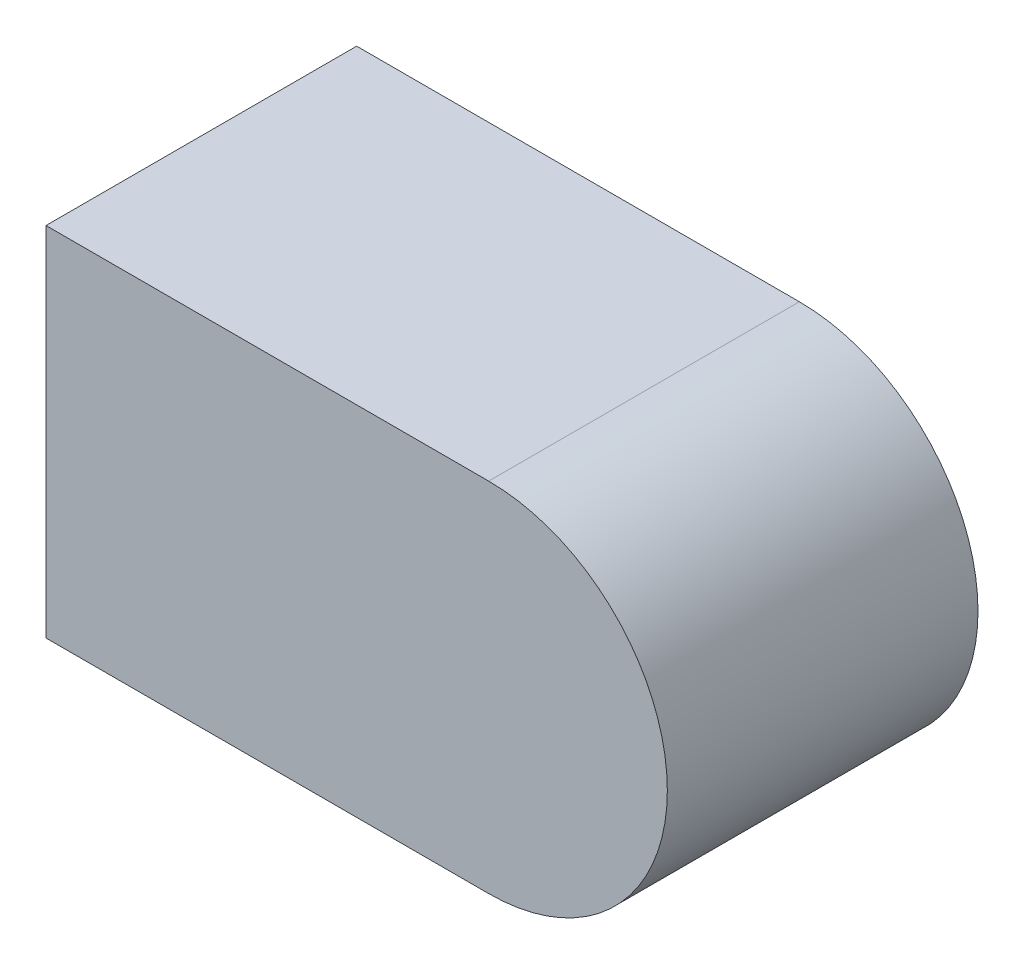
ISO-10303-21;
HEADER;
FILE_DESCRIPTION(('STEP AP214'),'2;1');
FILE_NAME('part.step','',(''),(''),'','','');
FILE_SCHEMA(('AUTOMOTIVE_DESIGN { 1 0 10303 214 1 1 1 1 }'));
ENDSEC;
DATA;
#1=APPLICATION_CONTEXT('core data for automotive mechanical design processes');
#2=APPLICATION_PROTOCOL_DEFINITION('international standard','automotive_design',2000,#1);
#3=PRODUCT_CONTEXT('',#1,'mechanical');
#4=PRODUCT('Part','Part','',(#3));
#5=PRODUCT_RELATED_PRODUCT_CATEGORY('part','',(#4));
#6=PRODUCT_DEFINITION_FORMATION('','',#4);
#7=PRODUCT_DEFINITION_CONTEXT('part definition',#1,'design');
#8=PRODUCT_DEFINITION('design','',#6,#7);
#9=PRODUCT_DEFINITION_SHAPE('','',#8);
#10=(LENGTH_UNIT() NAMED_UNIT(*) SI_UNIT(.MILLI.,.METRE.));
#11=(NAMED_UNIT(*) PLANE_ANGLE_UNIT() SI_UNIT($,.RADIAN.));
#12=(NAMED_UNIT(*) SI_UNIT($,.STERADIAN.) SOLID_ANGLE_UNIT());
#13=UNCERTAINTY_MEASURE_WITH_UNIT(LENGTH_MEASURE(1.E-05),#10,'distance_accuracy_value','');
#14=(GEOMETRIC_REPRESENTATION_CONTEXT(3) GLOBAL_UNCERTAINTY_ASSIGNED_CONTEXT((#13)) GLOBAL_UNIT_ASSIGNED_CONTEXT((#10,
#11,#12)) REPRESENTATION_CONTEXT('',''));
#15=CARTESIAN_POINT('',(0.,0.,0.));
#16=DIRECTION('',(0.,0.,1.));
#17=DIRECTION('',(1.,0.,0.));
#18=AXIS2_PLACEMENT_3D('',#15,#16,#17);
#19=CARTESIAN_POINT('',(-2.8335265642716,2.25,0.));
#20=DIRECTION('',(0.,0.,1.));
#21=DIRECTION('',(1.,0.,0.));
#22=AXIS2_PLACEMENT_3D('',#19,#20,#21);
#23=PLANE('',#22);
#24=DIRECTION('',(0.,-1.,0.));
#25=VECTOR('',#24,1.);
#26=CARTESIAN_POINT('',(-3.,2.365,0.));
#27=LINE('',#26,#25);
#28=CARTESIAN_POINT('',(-3.,2.365,0.));
#29=VERTEX_POINT('',#28);
#30=CARTESIAN_POINT('',(-3.,2.135,0.));
#31=VERTEX_POINT('',#30);
#32=EDGE_CURVE('E11',#29,#31,#27,.T.);
#33=ORIENTED_EDGE('',*,*,#32,.F.);
#34=DIRECTION('',(-1.,0.,0.));
#35=VECTOR('',#34,1.);
#36=CARTESIAN_POINT('',(-2.715,2.365,0.));
#37=LINE('',#36,#35);
#38=CARTESIAN_POINT('',(-2.715,2.365,0.));
#39=VERTEX_POINT('',#38);
#40=EDGE_CURVE('E24',#39,#29,#37,.T.);
#41=ORIENTED_EDGE('',*,*,#40,.F.);
#42=CARTESIAN_POINT('',(-2.715,2.25,0.));
#43=DIRECTION('',(0.,0.,1.));
#44=DIRECTION('',(0.,-1.,0.));
#45=AXIS2_PLACEMENT_3D('',#42,#43,#44);
#46=CIRCLE('',#45,0.115);
#47=CARTESIAN_POINT('',(-2.715,2.135,0.));
#48=VERTEX_POINT('',#47);
#49=EDGE_CURVE('E85',#48,#39,#46,.T.);
#50=ORIENTED_EDGE('',*,*,#49,.F.);
#51=DIRECTION('',(1.,0.,0.));
#52=VECTOR('',#51,1.);
#53=CARTESIAN_POINT('',(-3.,2.135,0.));
#54=LINE('',#53,#52);
#55=EDGE_CURVE('E82',#31,#48,#54,.T.);
#56=ORIENTED_EDGE('',*,*,#55,.F.);
#57=EDGE_LOOP('',(#33,#41,#50,#56));
#58=FACE_BOUND('',#57,.T.);
#59=ADVANCED_FACE('F17',(#58),#23,.F.);
#60=CARTESIAN_POINT('',(-3.,2.135,0.));
#61=DIRECTION('',(0.,-1.,0.));
#62=DIRECTION('',(1.,0.,0.));
#63=AXIS2_PLACEMENT_3D('',#60,#61,#62);
#64=PLANE('',#63);
#65=ORIENTED_EDGE('',*,*,#55,.T.);
#66=DIRECTION('',(0.,0.,1.));
#67=VECTOR('',#66,1.);
#68=CARTESIAN_POINT('',(-2.715,2.135,0.));
#69=LINE('',#68,#67);
#70=CARTESIAN_POINT('',(-2.715,2.135,0.2));
#71=VERTEX_POINT('',#70);
#72=EDGE_CURVE('E80',#48,#71,#69,.T.);
#73=ORIENTED_EDGE('',*,*,#72,.T.);
#74=DIRECTION('',(1.,0.,0.));
#75=VECTOR('',#74,1.);
#76=CARTESIAN_POINT('',(-3.,2.135,0.2));
#77=LINE('',#76,#75);
#78=CARTESIAN_POINT('',(-3.,2.135,0.2));
#79=VERTEX_POINT('',#78);
#80=EDGE_CURVE('E78',#79,#71,#77,.T.);
#81=ORIENTED_EDGE('',*,*,#80,.F.);
#82=DIRECTION('',(0.,0.,-1.));
#83=VECTOR('',#82,1.);
#84=CARTESIAN_POINT('',(-3.,2.135,0.));
#85=LINE('',#84,#83);
#86=EDGE_CURVE('E71',#79,#31,#85,.T.);
#87=ORIENTED_EDGE('',*,*,#86,.T.);
#88=EDGE_LOOP('',(#65,#73,#81,#87));
#89=FACE_BOUND('',#88,.T.);
#90=ADVANCED_FACE('F91',(#89),#64,.T.);
#91=CARTESIAN_POINT('',(-2.715,2.25,0.));
#92=DIRECTION('',(0.,0.,1.));
#93=DIRECTION('',(0.,-1.,0.));
#94=AXIS2_PLACEMENT_3D('',#91,#92,#93);
#95=CYLINDRICAL_SURFACE('',#94,0.115);
#96=ORIENTED_EDGE('',*,*,#49,.T.);
#97=DIRECTION('',(0.,0.,1.));
#98=VECTOR('',#97,1.);
#99=CARTESIAN_POINT('',(-2.715,2.365,0.));
#100=LINE('',#99,#98);
#101=CARTESIAN_POINT('',(-2.715,2.365,0.2));
#102=VERTEX_POINT('',#101);
#103=EDGE_CURVE('E75',#39,#102,#100,.T.);
#104=ORIENTED_EDGE('',*,*,#103,.T.);
#105=CARTESIAN_POINT('',(-2.715,2.25,0.2));
#106=DIRECTION('',(0.,0.,1.));
#107=DIRECTION('',(0.,-1.,0.));
#108=AXIS2_PLACEMENT_3D('',#105,#106,#107);
#109=CIRCLE('',#108,0.115);
#110=EDGE_CURVE('E59',#71,#102,#109,.T.);
#111=ORIENTED_EDGE('',*,*,#110,.F.);
#112=ORIENTED_EDGE('',*,*,#72,.F.);
#113=EDGE_LOOP('',(#96,#104,#111,#112));
#114=FACE_BOUND('',#113,.T.);
#115=ADVANCED_FACE('F89',(#114),#95,.T.);
#116=CARTESIAN_POINT('',(-2.715,2.365,0.));
#117=DIRECTION('',(0.,1.,0.));
#118=DIRECTION('',(-1.,0.,0.));
#119=AXIS2_PLACEMENT_3D('',#116,#117,#118);
#120=PLANE('',#119);
#121=ORIENTED_EDGE('',*,*,#40,.T.);
#122=DIRECTION('',(0.,0.,1.));
#123=VECTOR('',#122,1.);
#124=CARTESIAN_POINT('',(-3.,2.365,0.));
#125=LINE('',#124,#123);
#126=CARTESIAN_POINT('',(-3.,2.365,0.2));
#127=VERTEX_POINT('',#126);
#128=EDGE_CURVE('E53',#29,#127,#125,.T.);
#129=ORIENTED_EDGE('',*,*,#128,.T.);
#130=DIRECTION('',(-1.,0.,0.));
#131=VECTOR('',#130,1.);
#132=CARTESIAN_POINT('',(-2.715,2.365,0.2));
#133=LINE('',#132,#131);
#134=EDGE_CURVE('E57',#102,#127,#133,.T.);
#135=ORIENTED_EDGE('',*,*,#134,.F.);
#136=ORIENTED_EDGE('',*,*,#103,.F.);
#137=EDGE_LOOP('',(#121,#129,#135,#136));
#138=FACE_BOUND('',#137,.T.);
#139=ADVANCED_FACE('F55',(#138),#120,.T.);
#140=CARTESIAN_POINT('',(-3.,3.,0.));
#141=DIRECTION('',(-1.,0.,0.));
#142=DIRECTION('',(0.,-1.,0.));
#143=AXIS2_PLACEMENT_3D('',#140,#141,#142);
#144=PLANE('',#143);
#145=ORIENTED_EDGE('',*,*,#86,.F.);
#146=DIRECTION('',(0.,-1.,0.));
#147=VECTOR('',#146,1.);
#148=CARTESIAN_POINT('',(-3.,2.625,0.2));
#149=LINE('',#148,#147);
#150=EDGE_CURVE('E66',#127,#79,#149,.T.);
#151=ORIENTED_EDGE('',*,*,#150,.F.);
#152=ORIENTED_EDGE('',*,*,#128,.F.);
#153=ORIENTED_EDGE('',*,*,#32,.T.);
#154=EDGE_LOOP('',(#145,#151,#152,#153));
#155=FACE_BOUND('',#154,.T.);
#156=ADVANCED_FACE('F69',(#155),#144,.T.);
#157=CARTESIAN_POINT('',(-2.8335240809167,2.25,0.2));
#158=DIRECTION('',(0.,0.,1.));
#159=DIRECTION('',(1.,0.,0.));
#160=AXIS2_PLACEMENT_3D('',#157,#158,#159);
#161=PLANE('',#160);
#162=ORIENTED_EDGE('',*,*,#134,.T.);
#163=ORIENTED_EDGE('',*,*,#150,.T.);
#164=ORIENTED_EDGE('',*,*,#80,.T.);
#165=ORIENTED_EDGE('',*,*,#110,.T.);
#166=EDGE_LOOP('',(#162,#163,#164,#165));
#167=FACE_BOUND('',#166,.T.);
#168=ADVANCED_FACE('F64',(#167),#161,.T.);
#169=CLOSED_SHELL('',(#59,#90,#115,#139,#156,#168));
#170=MANIFOLD_SOLID_BREP('B1',#169);
#171=ADVANCED_BREP_SHAPE_REPRESENTATION('',(#18,#170),#14);
#172=SHAPE_DEFINITION_REPRESENTATION(#9,#171);
ENDSEC;
END-ISO-10303-21;
